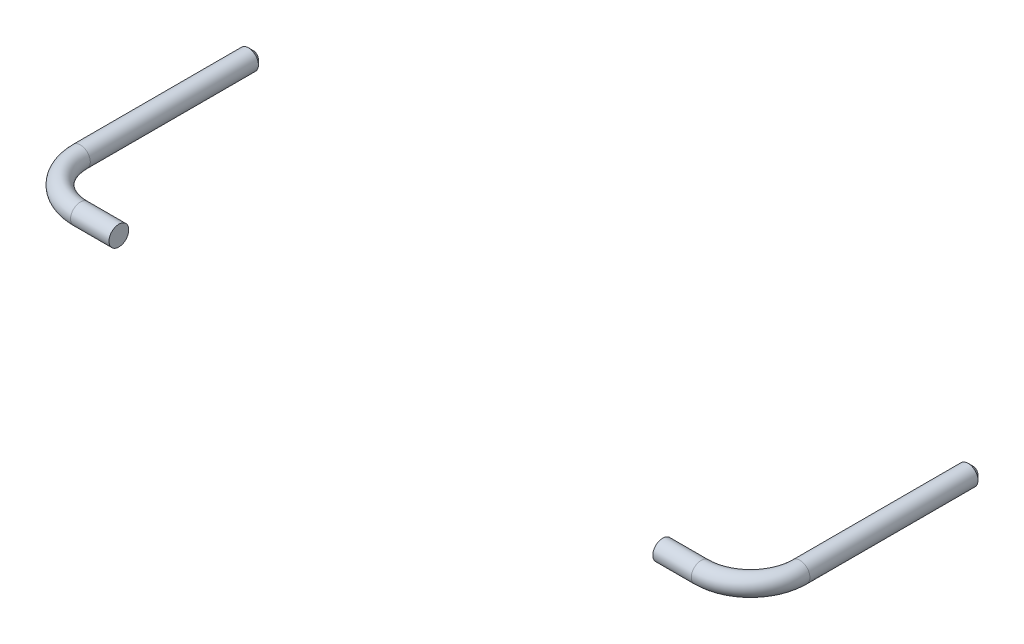
ISO-10303-21;
HEADER;
FILE_DESCRIPTION(('STEP AP214'),'2;1');
FILE_NAME('part.step','',(''),(''),'','','');
FILE_SCHEMA(('AUTOMOTIVE_DESIGN { 1 0 10303 214 1 1 1 1 }'));
ENDSEC;
DATA;
#1=APPLICATION_CONTEXT('core data for automotive mechanical design processes');
#2=APPLICATION_PROTOCOL_DEFINITION('international standard','automotive_design',2000,#1);
#3=PRODUCT_CONTEXT('',#1,'mechanical');
#4=PRODUCT('Part','Part','',(#3));
#5=PRODUCT_RELATED_PRODUCT_CATEGORY('part','',(#4));
#6=PRODUCT_DEFINITION_FORMATION('','',#4);
#7=PRODUCT_DEFINITION_CONTEXT('part definition',#1,'design');
#8=PRODUCT_DEFINITION('design','',#6,#7);
#9=PRODUCT_DEFINITION_SHAPE('','',#8);
#10=(LENGTH_UNIT() NAMED_UNIT(*) SI_UNIT(.MILLI.,.METRE.));
#11=(NAMED_UNIT(*) PLANE_ANGLE_UNIT() SI_UNIT($,.RADIAN.));
#12=(NAMED_UNIT(*) SI_UNIT($,.STERADIAN.) SOLID_ANGLE_UNIT());
#13=UNCERTAINTY_MEASURE_WITH_UNIT(LENGTH_MEASURE(1.E-05),#10,'distance_accuracy_value','');
#14=(GEOMETRIC_REPRESENTATION_CONTEXT(3) GLOBAL_UNCERTAINTY_ASSIGNED_CONTEXT((#13)) GLOBAL_UNIT_ASSIGNED_CONTEXT((#10,
#11,#12)) REPRESENTATION_CONTEXT('',''));
#15=CARTESIAN_POINT('',(0.,0.,0.));
#16=DIRECTION('',(0.,0.,1.));
#17=DIRECTION('',(1.,0.,0.));
#18=AXIS2_PLACEMENT_3D('',#15,#16,#17);
#19=CARTESIAN_POINT('',(12.555,0.,3.));
#20=DIRECTION('',(0.,1.,0.));
#21=DIRECTION('',(0.,0.,1.));
#22=AXIS2_PLACEMENT_3D('',#19,#20,#21);
#23=TOROIDAL_SURFACE('',#22,2.,0.4);
#24=CARTESIAN_POINT('',(14.555,0.,3.));
#25=DIRECTION('',(0.,0.,-1.));
#26=DIRECTION('',(0.,-1.,0.));
#27=AXIS2_PLACEMENT_3D('',#24,#25,#26);
#28=CIRCLE('',#27,0.4);
#29=CARTESIAN_POINT('',(14.555,0.4,3.));
#30=VERTEX_POINT('',#29);
#31=EDGE_CURVE('P0_E88',#30,#30,#28,.T.);
#32=ORIENTED_EDGE('',*,*,#31,.F.);
#33=CARTESIAN_POINT('',(12.555,0.4,5.));
#34=CARTESIAN_POINT('',(13.078598775598,0.4,5.));
#35=CARTESIAN_POINT('',(13.60215300141,0.4,4.835544627959));
#36=CARTESIAN_POINT('',(14.06138029928,0.4,4.50638029928));
#37=CARTESIAN_POINT('',(14.390544627959,0.4,4.04715300141));
#38=CARTESIAN_POINT('',(14.555,0.4,3.523598775598));
#39=CARTESIAN_POINT('',(14.555,0.4,3.));
#40=(BOUNDED_CURVE() B_SPLINE_CURVE(6,(#33,#34,#35,#36,#37,#38,#39),.UNSPECIFIED.,.F.,
.F.) B_SPLINE_CURVE_WITH_KNOTS((7,7),(0.,1.570796326795),
.UNSPECIFIED.) CURVE() GEOMETRIC_REPRESENTATION_ITEM() RATIONAL_B_SPLINE_CURVE((1.,1.,1.,1.,1.,
1.,1.)) REPRESENTATION_ITEM(''));
#41=CARTESIAN_POINT('',(12.555,0.4,5.));
#42=VERTEX_POINT('',#41);
#43=EDGE_CURVE('P0_E11',#42,#30,#40,.T.);
#44=ORIENTED_EDGE('',*,*,#43,.F.);
#45=CARTESIAN_POINT('',(12.555,0.,5.));
#46=DIRECTION('',(1.,0.,0.));
#47=DIRECTION('',(0.,-1.,0.));
#48=AXIS2_PLACEMENT_3D('',#45,#46,#47);
#49=CIRCLE('',#48,0.4);
#50=EDGE_CURVE('P0_E71',#42,#42,#49,.T.);
#51=ORIENTED_EDGE('',*,*,#50,.T.);
#52=ORIENTED_EDGE('',*,*,#43,.T.);
#53=EDGE_LOOP('',(#32,#44,#51,#52));
#54=FACE_BOUND('',#53,.T.);
#55=ADVANCED_FACE('P0_F17',(#54),#23,.T.);
#56=CARTESIAN_POINT('',(0.,0.,5.));
#57=DIRECTION('',(1.,0.,0.));
#58=DIRECTION('',(0.,-1.,0.));
#59=AXIS2_PLACEMENT_3D('',#56,#57,#58);
#60=CYLINDRICAL_SURFACE('',#59,0.4);
#61=ORIENTED_EDGE('',*,*,#50,.F.);
#62=CARTESIAN_POINT('',(11.,0.4,5.));
#63=CARTESIAN_POINT('',(12.555,0.4,5.));
#64=(BOUNDED_CURVE() B_SPLINE_CURVE(1,(#62,#63),.UNSPECIFIED.,.F.,
.F.) B_SPLINE_CURVE_WITH_KNOTS((2,2),(11.,12.555),
.UNSPECIFIED.) CURVE() GEOMETRIC_REPRESENTATION_ITEM() RATIONAL_B_SPLINE_CURVE((1.,1.)) REPRESENTATION_ITEM(''));
#65=CARTESIAN_POINT('',(11.,0.4,5.));
#66=VERTEX_POINT('',#65);
#67=EDGE_CURVE('P0_E28',#66,#42,#64,.T.);
#68=ORIENTED_EDGE('',*,*,#67,.F.);
#69=CARTESIAN_POINT('',(11.,0.,5.));
#70=DIRECTION('',(-1.,0.,0.));
#71=DIRECTION('',(0.,-1.,0.));
#72=AXIS2_PLACEMENT_3D('',#69,#70,#71);
#73=CIRCLE('',#72,0.4);
#74=EDGE_CURVE('P0_E21',#66,#66,#73,.T.);
#75=ORIENTED_EDGE('',*,*,#74,.F.);
#76=ORIENTED_EDGE('',*,*,#67,.T.);
#77=EDGE_LOOP('',(#61,#68,#75,#76));
#78=FACE_BOUND('',#77,.T.);
#79=ADVANCED_FACE('P0_F70',(#78),#60,.T.);
#80=CARTESIAN_POINT('',(14.555,0.,-4.));
#81=DIRECTION('',(0.,0.,-1.));
#82=DIRECTION('',(0.,-1.,0.));
#83=AXIS2_PLACEMENT_3D('',#80,#81,#82);
#84=PLANE('',#83);
#85=CARTESIAN_POINT('',(14.555,0.,-4.));
#86=DIRECTION('',(0.,0.,1.));
#87=DIRECTION('',(0.,-1.,0.));
#88=AXIS2_PLACEMENT_3D('',#85,#86,#87);
#89=CIRCLE('',#88,0.2);
#90=CARTESIAN_POINT('',(14.555,0.2,-4.));
#91=VERTEX_POINT('',#90);
#92=EDGE_CURVE('P0_E52',#91,#91,#89,.T.);
#93=ORIENTED_EDGE('',*,*,#92,.F.);
#94=EDGE_LOOP('',(#93));
#95=FACE_BOUND('',#94,.T.);
#96=ADVANCED_FACE('P0_F165',(#95),#84,.T.);
#97=CARTESIAN_POINT('',(14.555,0.,3.));
#98=DIRECTION('',(0.,0.,-1.));
#99=DIRECTION('',(0.,-1.,0.));
#100=AXIS2_PLACEMENT_3D('',#97,#98,#99);
#101=CYLINDRICAL_SURFACE('',#100,0.4);
#102=ORIENTED_EDGE('',*,*,#31,.T.);
#103=CARTESIAN_POINT('',(14.555,0.4,3.));
#104=CARTESIAN_POINT('',(14.555,0.4,-3.8));
#105=(BOUNDED_CURVE() B_SPLINE_CURVE(1,(#103,#104),.UNSPECIFIED.,.F.,
.F.) B_SPLINE_CURVE_WITH_KNOTS((2,2),(0.,6.8),
.UNSPECIFIED.) CURVE() GEOMETRIC_REPRESENTATION_ITEM() RATIONAL_B_SPLINE_CURVE((1.,1.)) REPRESENTATION_ITEM(''));
#106=CARTESIAN_POINT('',(14.555,0.4,-3.8));
#107=VERTEX_POINT('',#106);
#108=EDGE_CURVE('P0_E61',#30,#107,#105,.T.);
#109=ORIENTED_EDGE('',*,*,#108,.T.);
#110=CARTESIAN_POINT('',(14.555,0.,-3.8));
#111=DIRECTION('',(0.,0.,-1.));
#112=DIRECTION('',(0.,-1.,0.));
#113=AXIS2_PLACEMENT_3D('',#110,#111,#112);
#114=CIRCLE('',#113,0.4);
#115=EDGE_CURVE('P0_E76',#107,#107,#114,.T.);
#116=ORIENTED_EDGE('',*,*,#115,.F.);
#117=ORIENTED_EDGE('',*,*,#108,.F.);
#118=EDGE_LOOP('',(#102,#109,#116,#117));
#119=FACE_BOUND('',#118,.T.);
#120=ADVANCED_FACE('P0_F155',(#119),#101,.T.);
#121=CARTESIAN_POINT('',(14.555,0.,-3.9));
#122=DIRECTION('',(0.,0.,1.));
#123=DIRECTION('',(0.,-1.,0.));
#124=AXIS2_PLACEMENT_3D('',#121,#122,#123);
#125=CONICAL_SURFACE('',#124,0.3,0.7853981634);
#126=ORIENTED_EDGE('',*,*,#115,.T.);
#127=CARTESIAN_POINT('',(14.555,0.2,-4.));
#128=CARTESIAN_POINT('',(14.555,0.4,-3.8));
#129=(BOUNDED_CURVE() B_SPLINE_CURVE(1,(#127,#128),.UNSPECIFIED.,.F.,
.F.) B_SPLINE_CURVE_WITH_KNOTS((2,2),(-0.141421356237,0.141421356237),
.UNSPECIFIED.) CURVE() GEOMETRIC_REPRESENTATION_ITEM() RATIONAL_B_SPLINE_CURVE((1.,1.)) REPRESENTATION_ITEM(''));
#130=EDGE_CURVE('P0_E82',#91,#107,#129,.T.);
#131=ORIENTED_EDGE('',*,*,#130,.F.);
#132=ORIENTED_EDGE('',*,*,#92,.T.);
#133=ORIENTED_EDGE('',*,*,#130,.T.);
#134=EDGE_LOOP('',(#126,#131,#132,#133));
#135=FACE_BOUND('',#134,.T.);
#136=ADVANCED_FACE('P0_F145',(#135),#125,.T.);
#137=CARTESIAN_POINT('',(11.,4.75,-8.790379131818));
#138=DIRECTION('',(-1.,0.,0.));
#139=DIRECTION('',(0.,0.,1.));
#140=AXIS2_PLACEMENT_3D('',#137,#138,#139);
#141=PLANE('',#140);
#142=ORIENTED_EDGE('',*,*,#74,.T.);
#143=EDGE_LOOP('',(#142));
#144=FACE_BOUND('',#143,.T.);
#145=ADVANCED_FACE('P0_F19',(#144),#141,.T.);
#146=CLOSED_SHELL('',(#55,#79,#96,#120,#136,#145));
#147=MANIFOLD_SOLID_BREP('P0_B1',#146);
#148=CARTESIAN_POINT('',(-11.,4.75,9.5));
#149=DIRECTION('',(1.,0.,0.));
#150=DIRECTION('',(0.,1.,0.));
#151=AXIS2_PLACEMENT_3D('',#148,#149,#150);
#152=PLANE('',#151);
#153=CARTESIAN_POINT('',(-11.,0.,5.));
#154=DIRECTION('',(1.,0.,0.));
#155=DIRECTION('',(0.,-1.,0.));
#156=AXIS2_PLACEMENT_3D('',#153,#154,#155);
#157=CIRCLE('',#156,0.4);
#158=CARTESIAN_POINT('',(-11.,0.4,5.));
#159=VERTEX_POINT('',#158);
#160=EDGE_CURVE('P1_E11',#159,#159,#157,.T.);
#161=ORIENTED_EDGE('',*,*,#160,.T.);
#162=EDGE_LOOP('',(#161));
#163=FACE_BOUND('',#162,.T.);
#164=ADVANCED_FACE('P1_F17',(#163),#152,.T.);
#165=CARTESIAN_POINT('',(0.,0.,5.));
#166=DIRECTION('',(1.,0.,0.));
#167=DIRECTION('',(0.,-1.,0.));
#168=AXIS2_PLACEMENT_3D('',#165,#166,#167);
#169=CYLINDRICAL_SURFACE('',#168,0.4);
#170=CARTESIAN_POINT('',(-12.555,0.,5.));
#171=DIRECTION('',(1.,0.,0.));
#172=DIRECTION('',(0.,-1.,0.));
#173=AXIS2_PLACEMENT_3D('',#170,#171,#172);
#174=CIRCLE('',#173,0.4);
#175=CARTESIAN_POINT('',(-12.555,0.4,5.));
#176=VERTEX_POINT('',#175);
#177=EDGE_CURVE('P1_E61',#176,#176,#174,.T.);
#178=ORIENTED_EDGE('',*,*,#177,.T.);
#179=CARTESIAN_POINT('',(-12.555,0.4,5.));
#180=CARTESIAN_POINT('',(-11.,0.4,5.));
#181=(BOUNDED_CURVE() B_SPLINE_CURVE(1,(#179,#180),.UNSPECIFIED.,.F.,
.F.) B_SPLINE_CURVE_WITH_KNOTS((2,2),(-12.555,-11.),
.UNSPECIFIED.) CURVE() GEOMETRIC_REPRESENTATION_ITEM() RATIONAL_B_SPLINE_CURVE((1.,1.)) REPRESENTATION_ITEM(''));
#182=EDGE_CURVE('P1_E27',#176,#159,#181,.T.);
#183=ORIENTED_EDGE('',*,*,#182,.T.);
#184=ORIENTED_EDGE('',*,*,#160,.F.);
#185=ORIENTED_EDGE('',*,*,#182,.F.);
#186=EDGE_LOOP('',(#178,#183,#184,#185));
#187=FACE_BOUND('',#186,.T.);
#188=ADVANCED_FACE('P1_F59',(#187),#169,.T.);
#189=CARTESIAN_POINT('',(-14.555,0.,-3.9));
#190=DIRECTION('',(0.,0.,1.));
#191=DIRECTION('',(0.,-1.,0.));
#192=AXIS2_PLACEMENT_3D('',#189,#190,#191);
#193=CONICAL_SURFACE('',#192,0.3,0.7853981634);
#194=CARTESIAN_POINT('',(-14.555,0.,-3.8));
#195=DIRECTION('',(0.,0.,1.));
#196=DIRECTION('',(0.,-1.,0.));
#197=AXIS2_PLACEMENT_3D('',#194,#195,#196);
#198=CIRCLE('',#197,0.4);
#199=CARTESIAN_POINT('',(-14.555,0.4,-3.8));
#200=VERTEX_POINT('',#199);
#201=EDGE_CURVE('P1_E68',#200,#200,#198,.T.);
#202=ORIENTED_EDGE('',*,*,#201,.F.);
#203=CARTESIAN_POINT('',(-14.555,0.2,-4.));
#204=CARTESIAN_POINT('',(-14.555,0.4,-3.8));
#205=(BOUNDED_CURVE() B_SPLINE_CURVE(1,(#203,#204),.UNSPECIFIED.,.F.,
.F.) B_SPLINE_CURVE_WITH_KNOTS((2,2),(-0.141421356237,0.141421356237),
.UNSPECIFIED.) CURVE() GEOMETRIC_REPRESENTATION_ITEM() RATIONAL_B_SPLINE_CURVE((1.,1.)) REPRESENTATION_ITEM(''));
#206=CARTESIAN_POINT('',(-14.555,0.2,-4.));
#207=VERTEX_POINT('',#206);
#208=EDGE_CURVE('P1_E51',#207,#200,#205,.T.);
#209=ORIENTED_EDGE('',*,*,#208,.F.);
#210=CARTESIAN_POINT('',(-14.555,0.,-4.));
#211=DIRECTION('',(0.,0.,-1.));
#212=DIRECTION('',(0.,-1.,0.));
#213=AXIS2_PLACEMENT_3D('',#210,#211,#212);
#214=CIRCLE('',#213,0.2);
#215=EDGE_CURVE('P1_E90',#207,#207,#214,.T.);
#216=ORIENTED_EDGE('',*,*,#215,.F.);
#217=ORIENTED_EDGE('',*,*,#208,.T.);
#218=EDGE_LOOP('',(#202,#209,#216,#217));
#219=FACE_BOUND('',#218,.T.);
#220=ADVANCED_FACE('P1_F19',(#219),#193,.T.);
#221=CARTESIAN_POINT('',(-14.555,0.,3.));
#222=DIRECTION('',(0.,0.,1.));
#223=DIRECTION('',(0.,-1.,0.));
#224=AXIS2_PLACEMENT_3D('',#221,#222,#223);
#225=CYLINDRICAL_SURFACE('',#224,0.4);
#226=CARTESIAN_POINT('',(-14.555,0.,3.));
#227=DIRECTION('',(0.,0.,1.));
#228=DIRECTION('',(0.,-1.,0.));
#229=AXIS2_PLACEMENT_3D('',#226,#227,#228);
#230=CIRCLE('',#229,0.4);
#231=CARTESIAN_POINT('',(-14.555,0.4,3.));
#232=VERTEX_POINT('',#231);
#233=EDGE_CURVE('P1_E72',#232,#232,#230,.T.);
#234=ORIENTED_EDGE('',*,*,#233,.F.);
#235=CARTESIAN_POINT('',(-14.555,0.4,-3.8));
#236=CARTESIAN_POINT('',(-14.555,0.4,3.));
#237=(BOUNDED_CURVE() B_SPLINE_CURVE(1,(#235,#236),.UNSPECIFIED.,.F.,
.F.) B_SPLINE_CURVE_WITH_KNOTS((2,2),(-6.8,0.),
.UNSPECIFIED.) CURVE() GEOMETRIC_REPRESENTATION_ITEM() RATIONAL_B_SPLINE_CURVE((1.,1.)) REPRESENTATION_ITEM(''));
#238=EDGE_CURVE('P1_E85',#200,#232,#237,.T.);
#239=ORIENTED_EDGE('',*,*,#238,.F.);
#240=ORIENTED_EDGE('',*,*,#201,.T.);
#241=ORIENTED_EDGE('',*,*,#238,.T.);
#242=EDGE_LOOP('',(#234,#239,#240,#241));
#243=FACE_BOUND('',#242,.T.);
#244=ADVANCED_FACE('P1_F116',(#243),#225,.T.);
#245=CARTESIAN_POINT('',(-14.555,0.,-4.));
#246=DIRECTION('',(0.,0.,1.));
#247=DIRECTION('',(1.,0.,0.));
#248=AXIS2_PLACEMENT_3D('',#245,#246,#247);
#249=PLANE('',#248);
#250=ORIENTED_EDGE('',*,*,#215,.T.);
#251=EDGE_LOOP('',(#250));
#252=FACE_BOUND('',#251,.T.);
#253=ADVANCED_FACE('P1_F118',(#252),#249,.F.);
#254=CARTESIAN_POINT('',(-12.555,0.,3.));
#255=DIRECTION('',(0.,1.,0.));
#256=DIRECTION('',(0.,0.,1.));
#257=AXIS2_PLACEMENT_3D('',#254,#255,#256);
#258=TOROIDAL_SURFACE('',#257,2.,0.4);
#259=ORIENTED_EDGE('',*,*,#233,.T.);
#260=CARTESIAN_POINT('',(-14.555,0.4,3.));
#261=CARTESIAN_POINT('',(-14.555,0.4,3.523598775598));
#262=CARTESIAN_POINT('',(-14.39054462796,0.4,4.04715300141));
#263=CARTESIAN_POINT('',(-14.06138029928,0.4,4.50638029928));
#264=CARTESIAN_POINT('',(-13.60215300141,0.4,4.835544627959));
#265=CARTESIAN_POINT('',(-13.07859877559,0.4,5.));
#266=CARTESIAN_POINT('',(-12.555,0.4,5.));
#267=(BOUNDED_CURVE() B_SPLINE_CURVE(6,(#260,#261,#262,#263,#264,#265,#266),.UNSPECIFIED.,.F.,
.F.) B_SPLINE_CURVE_WITH_KNOTS((7,7),(4.712388980385,6.28318530718),
.UNSPECIFIED.) CURVE() GEOMETRIC_REPRESENTATION_ITEM() RATIONAL_B_SPLINE_CURVE((1.,1.,1.,1.,1.,
1.,1.)) REPRESENTATION_ITEM(''));
#268=EDGE_CURVE('P1_E84',#232,#176,#267,.T.);
#269=ORIENTED_EDGE('',*,*,#268,.T.);
#270=ORIENTED_EDGE('',*,*,#177,.F.);
#271=ORIENTED_EDGE('',*,*,#268,.F.);
#272=EDGE_LOOP('',(#259,#269,#270,#271));
#273=FACE_BOUND('',#272,.T.);
#274=ADVANCED_FACE('P1_F112',(#273),#258,.T.);
#275=CLOSED_SHELL('',(#164,#188,#220,#244,#253,#274));
#276=MANIFOLD_SOLID_BREP('P1_B1',#275);
#277=ADVANCED_BREP_SHAPE_REPRESENTATION('',(#18,#147,#276),#14);
#278=SHAPE_DEFINITION_REPRESENTATION(#9,#277);
ENDSEC;
END-ISO-10303-21;
